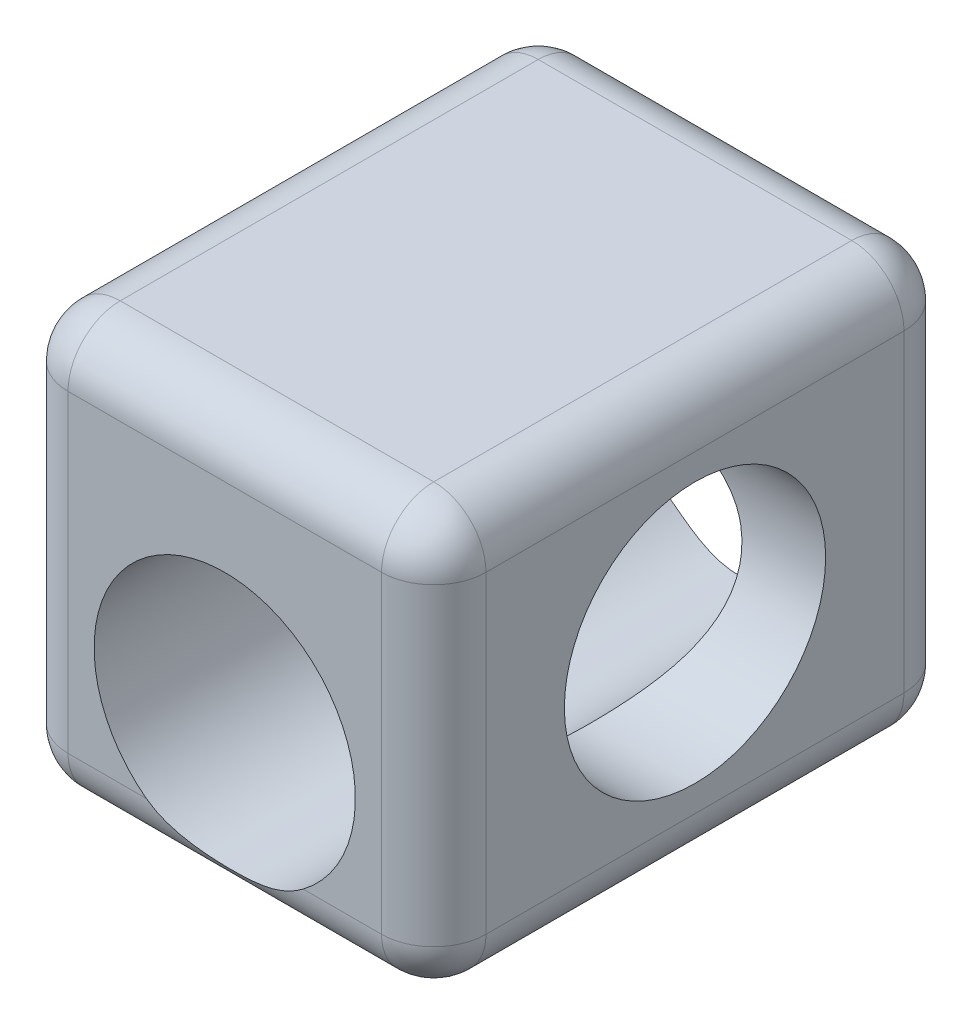
ISO-10303-21;
HEADER;
FILE_DESCRIPTION(('STEP AP214'),'2;1');
FILE_NAME('part.step','',(''),(''),'','','');
FILE_SCHEMA(('AUTOMOTIVE_DESIGN { 1 0 10303 214 1 1 1 1 }'));
ENDSEC;
DATA;
#1=APPLICATION_CONTEXT('core data for automotive mechanical design processes');
#2=APPLICATION_PROTOCOL_DEFINITION('international standard','automotive_design',2000,#1);
#3=PRODUCT_CONTEXT('',#1,'mechanical');
#4=PRODUCT('Part','Part','',(#3));
#5=PRODUCT_RELATED_PRODUCT_CATEGORY('part','',(#4));
#6=PRODUCT_DEFINITION_FORMATION('','',#4);
#7=PRODUCT_DEFINITION_CONTEXT('part definition',#1,'design');
#8=PRODUCT_DEFINITION('design','',#6,#7);
#9=PRODUCT_DEFINITION_SHAPE('','',#8);
#10=(LENGTH_UNIT() NAMED_UNIT(*) SI_UNIT(.MILLI.,.METRE.));
#11=(NAMED_UNIT(*) PLANE_ANGLE_UNIT() SI_UNIT($,.RADIAN.));
#12=(NAMED_UNIT(*) SI_UNIT($,.STERADIAN.) SOLID_ANGLE_UNIT());
#13=UNCERTAINTY_MEASURE_WITH_UNIT(LENGTH_MEASURE(1.E-05),#10,'distance_accuracy_value','');
#14=(GEOMETRIC_REPRESENTATION_CONTEXT(3) GLOBAL_UNCERTAINTY_ASSIGNED_CONTEXT((#13)) GLOBAL_UNIT_ASSIGNED_CONTEXT((#10,
#11,#12)) REPRESENTATION_CONTEXT('',''));
#15=CARTESIAN_POINT('',(0.,0.,0.));
#16=DIRECTION('',(0.,0.,1.));
#17=DIRECTION('',(1.,0.,0.));
#18=AXIS2_PLACEMENT_3D('',#15,#16,#17);
#19=CARTESIAN_POINT('',(0.,8.,10.));
#20=DIRECTION('',(1.,0.,0.));
#21=DIRECTION('',(0.,0.,-1.));
#22=AXIS2_PLACEMENT_3D('',#19,#20,#21);
#23=PLANE('',#22);
#24=DIRECTION('',(0.,0.,-1.));
#25=VECTOR('',#24,1.);
#26=CARTESIAN_POINT('',(0.,7.,10.));
#27=LINE('',#26,#25);
#28=CARTESIAN_POINT('',(0.,7.,9.));
#29=VERTEX_POINT('',#28);
#30=CARTESIAN_POINT('',(0.,7.,0.999999999999999));
#31=VERTEX_POINT('',#30);
#32=EDGE_CURVE('E178',#29,#31,#27,.T.);
#33=ORIENTED_EDGE('',*,*,#32,.T.);
#34=DIRECTION('',(0.,-1.,0.));
#35=VECTOR('',#34,1.);
#36=CARTESIAN_POINT('',(0.,8.,0.999999999999999));
#37=LINE('',#36,#35);
#38=CARTESIAN_POINT('',(0.,1.,0.999999999999999));
#39=VERTEX_POINT('',#38);
#40=EDGE_CURVE('E185',#31,#39,#37,.T.);
#41=ORIENTED_EDGE('',*,*,#40,.T.);
#42=DIRECTION('',(0.,0.,-1.));
#43=VECTOR('',#42,1.);
#44=CARTESIAN_POINT('',(0.,1.,10.));
#45=LINE('',#44,#43);
#46=CARTESIAN_POINT('',(0.,1.,9.));
#47=VERTEX_POINT('',#46);
#48=EDGE_CURVE('E146',#39,#47,#45,.F.);
#49=ORIENTED_EDGE('',*,*,#48,.T.);
#50=DIRECTION('',(0.,-1.,0.));
#51=VECTOR('',#50,1.);
#52=CARTESIAN_POINT('',(0.,8.,9.));
#53=LINE('',#52,#51);
#54=EDGE_CURVE('E176',#47,#29,#53,.F.);
#55=ORIENTED_EDGE('',*,*,#54,.T.);
#56=EDGE_LOOP('',(#33,#41,#49,#55));
#57=FACE_BOUND('',#56,.T.);
#58=CARTESIAN_POINT('',(0.,4.,5.));
#59=DIRECTION('',(1.,0.,0.));
#60=DIRECTION('',(0.,0.,-1.));
#61=AXIS2_PLACEMENT_3D('',#58,#59,#60);
#62=CIRCLE('',#61,2.5);
#63=CARTESIAN_POINT('',(0.,4.,2.5));
#64=VERTEX_POINT('',#63);
#65=EDGE_CURVE('E236',#64,#64,#62,.T.);
#66=ORIENTED_EDGE('',*,*,#65,.T.);
#67=EDGE_LOOP('',(#66));
#68=FACE_BOUND('',#67,.T.);
#69=ADVANCED_FACE('F39',(#57,#68),#23,.F.);
#70=CARTESIAN_POINT('',(0.,0.,10.));
#71=DIRECTION('',(0.,1.,0.));
#72=DIRECTION('',(0.,0.,1.));
#73=AXIS2_PLACEMENT_3D('',#70,#71,#72);
#74=PLANE('',#73);
#75=DIRECTION('',(1.,0.,0.));
#76=VECTOR('',#75,1.);
#77=CARTESIAN_POINT('',(0.,0.,9.));
#78=LINE('',#77,#76);
#79=CARTESIAN_POINT('',(7.,0.,9.));
#80=VERTEX_POINT('',#79);
#81=CARTESIAN_POINT('',(1.,0.,9.));
#82=VERTEX_POINT('',#81);
#83=EDGE_CURVE('E174',#80,#82,#78,.F.);
#84=ORIENTED_EDGE('',*,*,#83,.T.);
#85=DIRECTION('',(0.,0.,-1.));
#86=VECTOR('',#85,1.);
#87=CARTESIAN_POINT('',(1.,0.,10.));
#88=LINE('',#87,#86);
#89=CARTESIAN_POINT('',(1.,0.,0.999999999999999));
#90=VERTEX_POINT('',#89);
#91=EDGE_CURVE('E144',#82,#90,#88,.T.);
#92=ORIENTED_EDGE('',*,*,#91,.T.);
#93=DIRECTION('',(1.,0.,0.));
#94=VECTOR('',#93,1.);
#95=CARTESIAN_POINT('',(0.,0.,0.999999999999999));
#96=LINE('',#95,#94);
#97=CARTESIAN_POINT('',(7.,0.,0.999999999999999));
#98=VERTEX_POINT('',#97);
#99=EDGE_CURVE('E162',#90,#98,#96,.T.);
#100=ORIENTED_EDGE('',*,*,#99,.T.);
#101=DIRECTION('',(0.,0.,-1.));
#102=VECTOR('',#101,1.);
#103=CARTESIAN_POINT('',(7.,0.,10.));
#104=LINE('',#103,#102);
#105=EDGE_CURVE('E169',#98,#80,#104,.F.);
#106=ORIENTED_EDGE('',*,*,#105,.T.);
#107=EDGE_LOOP('',(#84,#92,#100,#106));
#108=FACE_BOUND('',#107,.T.);
#109=ADVANCED_FACE('F172',(#108),#74,.F.);
#110=CARTESIAN_POINT('',(8.,8.,10.));
#111=DIRECTION('',(-1.,0.,0.));
#112=DIRECTION('',(0.,0.,1.));
#113=AXIS2_PLACEMENT_3D('',#110,#111,#112);
#114=PLANE('',#113);
#115=DIRECTION('',(0.,0.,-1.));
#116=VECTOR('',#115,1.);
#117=CARTESIAN_POINT('',(8.,7.,10.));
#118=LINE('',#117,#116);
#119=CARTESIAN_POINT('',(8.,7.,0.999999999999999));
#120=VERTEX_POINT('',#119);
#121=CARTESIAN_POINT('',(8.,7.,9.));
#122=VERTEX_POINT('',#121);
#123=EDGE_CURVE('E338',#120,#122,#118,.F.);
#124=ORIENTED_EDGE('',*,*,#123,.T.);
#125=DIRECTION('',(0.,1.,0.));
#126=VECTOR('',#125,1.);
#127=CARTESIAN_POINT('',(8.,0.,9.));
#128=LINE('',#127,#126);
#129=CARTESIAN_POINT('',(8.,1.,9.));
#130=VERTEX_POINT('',#129);
#131=EDGE_CURVE('E345',#122,#130,#128,.F.);
#132=ORIENTED_EDGE('',*,*,#131,.T.);
#133=DIRECTION('',(0.,0.,-1.));
#134=VECTOR('',#133,1.);
#135=CARTESIAN_POINT('',(8.,1.,10.));
#136=LINE('',#135,#134);
#137=CARTESIAN_POINT('',(8.,1.,0.999999999999999));
#138=VERTEX_POINT('',#137);
#139=EDGE_CURVE('E248',#130,#138,#136,.T.);
#140=ORIENTED_EDGE('',*,*,#139,.T.);
#141=DIRECTION('',(0.,1.,0.));
#142=VECTOR('',#141,1.);
#143=CARTESIAN_POINT('',(8.,8.,0.999999999999999));
#144=LINE('',#143,#142);
#145=EDGE_CURVE('E337',#138,#120,#144,.T.);
#146=ORIENTED_EDGE('',*,*,#145,.T.);
#147=EDGE_LOOP('',(#124,#132,#140,#146));
#148=FACE_BOUND('',#147,.T.);
#149=CARTESIAN_POINT('',(8.,4.,5.));
#150=DIRECTION('',(1.,0.,0.));
#151=DIRECTION('',(0.,0.,-1.));
#152=AXIS2_PLACEMENT_3D('',#149,#150,#151);
#153=CIRCLE('',#152,2.5);
#154=CARTESIAN_POINT('',(8.,4.,2.5));
#155=VERTEX_POINT('',#154);
#156=EDGE_CURVE('E317',#155,#155,#153,.T.);
#157=ORIENTED_EDGE('',*,*,#156,.F.);
#158=EDGE_LOOP('',(#157));
#159=FACE_BOUND('',#158,.T.);
#160=ADVANCED_FACE('F393',(#148,#159),#114,.F.);
#161=CARTESIAN_POINT('',(0.,8.,10.));
#162=DIRECTION('',(0.,-1.,0.));
#163=DIRECTION('',(0.,0.,-1.));
#164=AXIS2_PLACEMENT_3D('',#161,#162,#163);
#165=PLANE('',#164);
#166=DIRECTION('',(-1.,0.,0.));
#167=VECTOR('',#166,1.);
#168=CARTESIAN_POINT('',(8.,8.,9.));
#169=LINE('',#168,#167);
#170=CARTESIAN_POINT('',(1.,8.,9.));
#171=VERTEX_POINT('',#170);
#172=CARTESIAN_POINT('',(7.,8.,9.));
#173=VERTEX_POINT('',#172);
#174=EDGE_CURVE('E48',#171,#173,#169,.F.);
#175=ORIENTED_EDGE('',*,*,#174,.T.);
#176=DIRECTION('',(0.,0.,-1.));
#177=VECTOR('',#176,1.);
#178=CARTESIAN_POINT('',(7.,8.,10.));
#179=LINE('',#178,#177);
#180=CARTESIAN_POINT('',(7.,8.,0.999999999999999));
#181=VERTEX_POINT('',#180);
#182=EDGE_CURVE('E11',#173,#181,#179,.T.);
#183=ORIENTED_EDGE('',*,*,#182,.T.);
#184=DIRECTION('',(-1.,0.,0.));
#185=VECTOR('',#184,1.);
#186=CARTESIAN_POINT('',(0.,8.,0.999999999999999));
#187=LINE('',#186,#185);
#188=CARTESIAN_POINT('',(1.,8.,0.999999999999999));
#189=VERTEX_POINT('',#188);
#190=EDGE_CURVE('E357',#181,#189,#187,.T.);
#191=ORIENTED_EDGE('',*,*,#190,.T.);
#192=DIRECTION('',(0.,0.,-1.));
#193=VECTOR('',#192,1.);
#194=CARTESIAN_POINT('',(1.,8.,10.));
#195=LINE('',#194,#193);
#196=EDGE_CURVE('E59',#189,#171,#195,.F.);
#197=ORIENTED_EDGE('',*,*,#196,.T.);
#198=EDGE_LOOP('',(#175,#183,#191,#197));
#199=FACE_BOUND('',#198,.T.);
#200=ADVANCED_FACE('F360',(#199),#165,.F.);
#201=CARTESIAN_POINT('',(0.,0.,10.));
#202=DIRECTION('',(0.,0.,1.));
#203=DIRECTION('',(1.,0.,0.));
#204=AXIS2_PLACEMENT_3D('',#201,#202,#203);
#205=PLANE('',#204);
#206=DIRECTION('',(0.,-1.,0.));
#207=VECTOR('',#206,1.);
#208=CARTESIAN_POINT('',(1.,0.,10.));
#209=LINE('',#208,#207);
#210=CARTESIAN_POINT('',(1.,7.,10.));
#211=VERTEX_POINT('',#210);
#212=CARTESIAN_POINT('',(1.,1.,10.));
#213=VERTEX_POINT('',#212);
#214=EDGE_CURVE('E193',#211,#213,#209,.T.);
#215=ORIENTED_EDGE('',*,*,#214,.T.);
#216=DIRECTION('',(1.,0.,0.));
#217=VECTOR('',#216,1.);
#218=CARTESIAN_POINT('',(8.,1.,10.));
#219=LINE('',#218,#217);
#220=CARTESIAN_POINT('',(2.5,1.,10.));
#221=VERTEX_POINT('',#220);
#222=EDGE_CURVE('E195',#213,#221,#219,.T.);
#223=ORIENTED_EDGE('',*,*,#222,.T.);
#224=CARTESIAN_POINT('',(4.,3.,10.));
#225=DIRECTION('',(0.,0.,1.));
#226=DIRECTION('',(1.,0.,0.));
#227=AXIS2_PLACEMENT_3D('',#224,#225,#226);
#228=CIRCLE('',#227,2.5);
#229=CARTESIAN_POINT('',(5.5,1.,10.));
#230=VERTEX_POINT('',#229);
#231=EDGE_CURVE('E235',#230,#221,#228,.T.);
#232=ORIENTED_EDGE('',*,*,#231,.F.);
#233=DIRECTION('',(1.,0.,0.));
#234=VECTOR('',#233,1.);
#235=CARTESIAN_POINT('',(8.,1.,10.));
#236=LINE('',#235,#234);
#237=CARTESIAN_POINT('',(7.,1.,10.));
#238=VERTEX_POINT('',#237);
#239=EDGE_CURVE('E191',#230,#238,#236,.T.);
#240=ORIENTED_EDGE('',*,*,#239,.T.);
#241=DIRECTION('',(0.,1.,0.));
#242=VECTOR('',#241,1.);
#243=CARTESIAN_POINT('',(7.,8.,10.));
#244=LINE('',#243,#242);
#245=CARTESIAN_POINT('',(7.,7.,10.));
#246=VERTEX_POINT('',#245);
#247=EDGE_CURVE('E187',#238,#246,#244,.T.);
#248=ORIENTED_EDGE('',*,*,#247,.T.);
#249=DIRECTION('',(-1.,0.,0.));
#250=VECTOR('',#249,1.);
#251=CARTESIAN_POINT('',(0.,7.,10.));
#252=LINE('',#251,#250);
#253=EDGE_CURVE('E189',#246,#211,#252,.T.);
#254=ORIENTED_EDGE('',*,*,#253,.T.);
#255=EDGE_LOOP('',(#215,#223,#232,#240,#248,#254));
#256=FACE_BOUND('',#255,.T.);
#257=ADVANCED_FACE('F224',(#256),#205,.T.);
#258=CARTESIAN_POINT('',(0.,0.,0.));
#259=DIRECTION('',(0.,0.,1.));
#260=DIRECTION('',(1.,0.,0.));
#261=AXIS2_PLACEMENT_3D('',#258,#259,#260);
#262=PLANE('',#261);
#263=CARTESIAN_POINT('',(4.,3.,0.));
#264=DIRECTION('',(0.,0.,1.));
#265=DIRECTION('',(1.,0.,0.));
#266=AXIS2_PLACEMENT_3D('',#263,#264,#265);
#267=CIRCLE('',#266,2.5);
#268=CARTESIAN_POINT('',(5.5,1.,0.));
#269=VERTEX_POINT('',#268);
#270=CARTESIAN_POINT('',(2.5,1.,0.));
#271=VERTEX_POINT('',#270);
#272=EDGE_CURVE('E170',#269,#271,#267,.T.);
#273=ORIENTED_EDGE('',*,*,#272,.T.);
#274=DIRECTION('',(1.,0.,0.));
#275=VECTOR('',#274,1.);
#276=CARTESIAN_POINT('',(0.,1.,0.));
#277=LINE('',#276,#275);
#278=CARTESIAN_POINT('',(1.,1.,0.));
#279=VERTEX_POINT('',#278);
#280=EDGE_CURVE('E355',#271,#279,#277,.F.);
#281=ORIENTED_EDGE('',*,*,#280,.T.);
#282=DIRECTION('',(0.,-1.,0.));
#283=VECTOR('',#282,1.);
#284=CARTESIAN_POINT('',(1.,0.,0.));
#285=LINE('',#284,#283);
#286=CARTESIAN_POINT('',(1.,7.,0.));
#287=VERTEX_POINT('',#286);
#288=EDGE_CURVE('E353',#279,#287,#285,.F.);
#289=ORIENTED_EDGE('',*,*,#288,.T.);
#290=DIRECTION('',(-1.,0.,0.));
#291=VECTOR('',#290,1.);
#292=CARTESIAN_POINT('',(0.,7.,0.));
#293=LINE('',#292,#291);
#294=CARTESIAN_POINT('',(7.,7.,0.));
#295=VERTEX_POINT('',#294);
#296=EDGE_CURVE('E349',#287,#295,#293,.F.);
#297=ORIENTED_EDGE('',*,*,#296,.T.);
#298=DIRECTION('',(0.,1.,0.));
#299=VECTOR('',#298,1.);
#300=CARTESIAN_POINT('',(7.,0.,0.));
#301=LINE('',#300,#299);
#302=CARTESIAN_POINT('',(7.,1.,0.));
#303=VERTEX_POINT('',#302);
#304=EDGE_CURVE('E347',#295,#303,#301,.F.);
#305=ORIENTED_EDGE('',*,*,#304,.T.);
#306=DIRECTION('',(1.,0.,0.));
#307=VECTOR('',#306,1.);
#308=CARTESIAN_POINT('',(0.,1.,0.));
#309=LINE('',#308,#307);
#310=EDGE_CURVE('E351',#303,#269,#309,.F.);
#311=ORIENTED_EDGE('',*,*,#310,.T.);
#312=EDGE_LOOP('',(#273,#281,#289,#297,#305,#311));
#313=FACE_BOUND('',#312,.T.);
#314=ADVANCED_FACE('F221',(#313),#262,.F.);
#315=CARTESIAN_POINT('',(4.,3.,0.));
#316=DIRECTION('',(0.,0.,1.));
#317=DIRECTION('',(1.,0.,0.));
#318=AXIS2_PLACEMENT_3D('',#315,#316,#317);
#319=CYLINDRICAL_SURFACE('',#318,2.5);
#320=CARTESIAN_POINT('',(6.5,3.,2.70871215252208));
#321=CARTESIAN_POINT('',(6.49999562364936,3.09636960452705,2.66665855443377));
#322=CARTESIAN_POINT('',(6.49438575877949,3.19556881166246,2.63065105152135));
#323=CARTESIAN_POINT('',(6.47044673908892,3.39640948639411,2.57169588159378));
#324=CARTESIAN_POINT('',(6.45209833179578,3.49805442559262,2.54876807833862));
#325=CARTESIAN_POINT('',(6.40222099724885,3.70010410872438,2.51594568100622));
#326=CARTESIAN_POINT('',(6.37070477042136,3.80050995195799,2.50603856647941));
#327=CARTESIAN_POINT('',(6.29506276880355,3.99688073206936,2.49806817258387));
#328=CARTESIAN_POINT('',(6.25093648607998,4.09284548987917,2.50000537036833));
#329=CARTESIAN_POINT('',(6.15125102895226,4.27796558041941,2.51376366906602));
#330=CARTESIAN_POINT('',(6.09567634099558,4.36711144581123,2.5255982490538));
#331=CARTESIAN_POINT('',(5.97457848702095,4.53685577901222,2.55679631081302));
#332=CARTESIAN_POINT('',(5.90905272574542,4.6174520077201,2.57616175871047));
#333=CARTESIAN_POINT('',(5.75750715261842,4.78205458744057,2.6236757924567));
#334=CARTESIAN_POINT('',(5.66989616694538,4.8643234565722,2.65275674118729));
#335=CARTESIAN_POINT('',(5.48438159720916,5.01517804145889,2.71394268962489));
#336=CARTESIAN_POINT('',(5.38646125390324,5.08374093514179,2.7460526042268));
#337=CARTESIAN_POINT('',(5.16237081239974,5.21788172724494,2.81517560470562));
#338=CARTESIAN_POINT('',(5.03434373578047,5.28049856749785,2.85198141884712));
#339=CARTESIAN_POINT('',(4.76762828224132,5.38350155801717,2.91681270659734));
#340=CARTESIAN_POINT('',(4.62896090007119,5.42393026505634,2.94485494390234));
#341=CARTESIAN_POINT('',(4.37504114183675,5.47432971303752,2.9808177778126));
#342=CARTESIAN_POINT('',(4.26115505431852,5.48897670538954,2.9917661810105));
#343=CARTESIAN_POINT('',(4.03197737881639,5.50242324075191,3.00179820440639));
#344=CARTESIAN_POINT('',(3.9166871570823,5.50123712348794,3.00089256058836));
#345=CARTESIAN_POINT('',(3.68828504171465,5.48313375120246,2.98743315875676));
#346=CARTESIAN_POINT('',(3.57516994961521,5.46624174109742,2.97489809340124));
#347=CARTESIAN_POINT('',(3.35359150571878,5.41765506817081,2.94060204106742));
#348=CARTESIAN_POINT('',(3.2451334733686,5.38594394509152,2.9188307975342));
#349=CARTESIAN_POINT('',(3.02703004262816,5.30603308912638,2.86770636110957));
#350=CARTESIAN_POINT('',(2.91786787234533,5.25680524400577,2.83791814661825));
#351=CARTESIAN_POINT('',(2.70809282856325,5.14364216954425,2.77598424656095));
#352=CARTESIAN_POINT('',(2.60748925990151,5.07969120628138,2.74383606422039));
#353=CARTESIAN_POINT('',(2.39699316019848,4.92373644152193,2.67505978513707));
#354=CARTESIAN_POINT('',(2.28920976350403,4.82868493024152,2.63880616047695));
#355=CARTESIAN_POINT('',(2.09034682965117,4.619849513422,2.57561674607517));
#356=CARTESIAN_POINT('',(1.9992411369208,4.50609548020693,2.5486663063537));
#357=CARTESIAN_POINT('',(1.85831446963736,4.29418734391639,2.51569157318341));
#358=CARTESIAN_POINT('',(1.80391459038605,4.19964093074983,2.50605248996927));
#359=CARTESIAN_POINT('',(1.70781127649285,4.00385523843533,2.49809028957286));
#360=CARTESIAN_POINT('',(1.66609556263093,3.9026225484383,2.49975619164543));
#361=CARTESIAN_POINT('',(1.59636017937647,3.69602519381801,2.5163781910643));
#362=CARTESIAN_POINT('',(1.56840366748648,3.59064382975396,2.53139470250632));
#363=CARTESIAN_POINT('',(1.52672781754488,3.38005945370369,2.57569734001322));
#364=CARTESIAN_POINT('',(1.51300860574556,3.27485644330733,2.60498359261467));
#365=CARTESIAN_POINT('',(1.49929042012606,3.07569696262362,2.67491247557134));
#366=CARTESIAN_POINT('',(1.49840194937765,2.98146764947102,2.71462149314084));
#367=CARTESIAN_POINT('',(1.50642283049841,2.79893151735397,2.80504680635885));
#368=CARTESIAN_POINT('',(1.51533480727163,2.7106262917908,2.85576604801128));
#369=CARTESIAN_POINT('',(1.5419627684122,2.53455934912744,2.97157648338016));
#370=CARTESIAN_POINT('',(1.56035323384247,2.44746180500528,3.0375153024269));
#371=CARTESIAN_POINT('',(1.60338606454822,2.2834509458013,3.17922306528643));
#372=CARTESIAN_POINT('',(1.6280315200912,2.20654269339105,3.25499685898467));
#373=CARTESIAN_POINT('',(1.68588939262996,2.04964493049329,3.43074530089175));
#374=CARTESIAN_POINT('',(1.71983521600732,1.97197920813149,3.53255777802295));
#375=CARTESIAN_POINT('',(1.78777191158143,1.83293393860121,3.74691902381809));
#376=CARTESIAN_POINT('',(1.8217627616599,1.7715824424272,3.85948583784667));
#377=CARTESIAN_POINT('',(1.88877535536037,1.65925579280959,4.10998718712405));
#378=CARTESIAN_POINT('',(1.92104971588306,1.61079179581959,4.24929627745561));
#379=CARTESIAN_POINT('',(1.95845430792976,1.55689255850258,4.46455292858872));
#380=CARTESIAN_POINT('',(1.96908383792828,1.54206337261575,4.53729238394436));
#381=CARTESIAN_POINT('',(1.98591336103457,1.51889726942397,4.68431810670796));
#382=CARTESIAN_POINT('',(1.99211480137615,1.51055823086204,4.75860386056219));
#383=CARTESIAN_POINT('',(1.99900367864985,1.5013202664089,4.89677046066263));
#384=CARTESIAN_POINT('',(2.00037347234405,1.49949999588053,4.96055736878207));
#385=CARTESIAN_POINT('',(1.99944922954483,1.50073641538939,5.08806425292482));
#386=CARTESIAN_POINT('',(1.99715401722693,1.50379467057787,5.15178420090222));
#387=CARTESIAN_POINT('',(1.98491596928052,1.5202460456157,5.34199807719833));
#388=CARTESIAN_POINT('',(1.96962386806199,1.54091143499317,5.46761245083302));
#389=CARTESIAN_POINT('',(1.93024455843012,1.59745544569817,5.70057214050699));
#390=CARTESIAN_POINT('',(1.90714469485372,1.63167973962442,5.80851258198411));
#391=CARTESIAN_POINT('',(1.85570579010303,1.71378376786906,6.0177650621544));
#392=CARTESIAN_POINT('',(1.82736359681227,1.7616717273482,6.11907306299736));
#393=CARTESIAN_POINT('',(1.76314742935553,1.88109344227483,6.33347764185705));
#394=CARTESIAN_POINT('',(1.72689794025508,1.95543743319845,6.44490117467264));
#395=CARTESIAN_POINT('',(1.65768562628312,2.12156200751489,6.65510957097795));
#396=CARTESIAN_POINT('',(1.62472212966815,2.2133390159476,6.75389701879049));
#397=CARTESIAN_POINT('',(1.5715298621127,2.39950481391521,6.92407962782446));
#398=CARTESIAN_POINT('',(1.550177508281,2.49183095038242,6.99737314261193));
#399=CARTESIAN_POINT('',(1.51767266181992,2.68725605937999,7.13087709283855));
#400=CARTESIAN_POINT('',(1.50651184873108,2.79034616734491,7.19109817004861));
#401=CARTESIAN_POINT('',(1.4998851604794,2.95137084879306,7.27024705746869));
#402=CARTESIAN_POINT('',(1.49938399313614,3.00638579127793,7.29485551032606));
#403=CARTESIAN_POINT('',(1.50216235907095,3.11795703216047,7.34000264982054));
#404=CARTESIAN_POINT('',(1.50543996176333,3.17451252907592,7.36054340837548));
#405=CARTESIAN_POINT('',(1.51605289151254,3.28859284944508,7.39739258565107));
#406=CARTESIAN_POINT('',(1.52338661208008,3.34611728039734,7.41370267623974));
#407=CARTESIAN_POINT('',(1.54227007431674,3.46150643259171,7.44204019056732));
#408=CARTESIAN_POINT('',(1.55381926875049,3.51937110870572,7.45406816979202));
#409=CARTESIAN_POINT('',(1.59123329284503,3.67700951954523,7.48111089699153));
#410=CARTESIAN_POINT('',(1.62139448178945,3.77654933546772,7.49189920472478));
#411=CARTESIAN_POINT('',(1.69412895734433,3.97150082445773,7.501748890102));
#412=CARTESIAN_POINT('',(1.73670449313262,4.06691174586951,7.50080814143524));
#413=CARTESIAN_POINT('',(1.83349050387682,4.25188715848501,7.48901829180106));
#414=CARTESIAN_POINT('',(1.88779077675297,4.34139914638454,7.47809048698529));
#415=CARTESIAN_POINT('',(2.00639190566996,4.51206614392245,7.44853076982768));
#416=CARTESIAN_POINT('',(2.07069511079133,4.59321918309227,7.42989704612502));
#417=CARTESIAN_POINT('',(2.21925378989226,4.75876607012343,7.38386491166031));
#418=CARTESIAN_POINT('',(2.30505207214521,4.84151151031655,7.35553058206475));
#419=CARTESIAN_POINT('',(2.48688181723827,4.99363019678246,7.29551822208842));
#420=CARTESIAN_POINT('',(2.58292937187074,5.0629819201343,7.26383493446152));
#421=CARTESIAN_POINT('',(2.80326623743487,5.19947525667264,7.19502820485869));
#422=CARTESIAN_POINT('',(2.92944395549193,5.26365842036529,7.15802299421092));
#423=CARTESIAN_POINT('',(3.19257449069017,5.37025844620234,7.09197486574972));
#424=CARTESIAN_POINT('',(3.32950891487487,5.41271156884843,7.06291872145779));
#425=CARTESIAN_POINT('',(3.58161933597555,5.46737653851487,7.02427463773899));
#426=CARTESIAN_POINT('',(3.69538994450608,5.4840443091868,7.01189297112861));
#427=CARTESIAN_POINT('',(3.92475464818978,5.50150580384605,6.99890376828337));
#428=CARTESIAN_POINT('',(4.04034666411498,5.50231647743822,6.99828366017442));
#429=CARTESIAN_POINT('',(4.26983564966892,5.48805293952072,7.0089211979309));
#430=CARTESIAN_POINT('',(4.38373410470858,5.47299359681313,7.02016772581983));
#431=CARTESIAN_POINT('',(4.60712922692672,5.42784203858947,7.05231954492697));
#432=CARTESIAN_POINT('',(4.71662071390214,5.39773265966891,7.07323586174309));
#433=CARTESIAN_POINT('',(4.93536030836218,5.32148354771546,7.12269886966573));
#434=CARTESIAN_POINT('',(5.04423532458913,5.27452447428068,7.1516139649913));
#435=CARTESIAN_POINT('',(5.25374261735999,5.16611707952636,7.21224542842442));
#436=CARTESIAN_POINT('',(5.35436641738349,5.10465410344438,7.24396460937825));
#437=CARTESIAN_POINT('',(5.56583081585669,4.95404331503916,7.31256915003031));
#438=CARTESIAN_POINT('',(5.67458070719677,4.86180671888253,7.34919156715775));
#439=CARTESIAN_POINT('',(5.87596275506494,4.65865366662464,7.41402166743761));
#440=CARTESIAN_POINT('',(5.96861673281396,4.5477629080783,7.44224078062672));
#441=CARTESIAN_POINT('',(6.11394000460549,4.33910477647271,7.47856705990134));
#442=CARTESIAN_POINT('',(6.17083459924625,4.2448481743515,7.48991831368601));
#443=CARTESIAN_POINT('',(6.27189001757165,4.0490999595036,7.50143366260894));
#444=CARTESIAN_POINT('',(6.31606325580254,3.94761552178736,7.50160870149716));
#445=CARTESIAN_POINT('',(6.39057369693342,3.73985857736837,7.48861451157638));
#446=CARTESIAN_POINT('',(6.42083936088447,3.63356433679003,7.47537738479211));
#447=CARTESIAN_POINT('',(6.46676616367562,3.42062362056066,7.4343516909419));
#448=CARTESIAN_POINT('',(6.48242852203144,3.31397717506867,7.40656433926162));
#449=CARTESIAN_POINT('',(6.49933834828347,3.11271293969574,7.33946234637597));
#450=CARTESIAN_POINT('',(6.5016312226401,3.01781224989861,7.30123762601708));
#451=CARTESIAN_POINT('',(6.49616238367775,2.83366477468027,7.21360999362048));
#452=CARTESIAN_POINT('',(6.48839802366393,2.74441948403646,7.16420414194369));
#453=CARTESIAN_POINT('',(6.46398398250955,2.56713801829029,7.0515203011866));
#454=CARTESIAN_POINT('',(6.4467267159019,2.47966630919601,6.98749264362777));
#455=CARTESIAN_POINT('',(6.40571856326536,2.31460783892092,6.84960544999337));
#456=CARTESIAN_POINT('',(6.38196488652063,2.23702534697841,6.77574169555829));
#457=CARTESIAN_POINT('',(6.32580184197004,2.07859145683545,6.60445579591041));
#458=CARTESIAN_POINT('',(6.29260608093013,1.9999633919507,6.50523172266139));
#459=CARTESIAN_POINT('',(6.22555639143772,1.85849326390498,6.29612846686979));
#460=CARTESIAN_POINT('',(6.19170139584072,1.79567957227878,6.18623061765695));
#461=CARTESIAN_POINT('',(6.1236733920156,1.67892313257905,5.94005896357947));
#462=CARTESIAN_POINT('',(6.09018565983407,1.62764303467006,5.80228295399186));
#463=CARTESIAN_POINT('',(6.05023845044756,1.56924100603216,5.58894097790305));
#464=CARTESIAN_POINT('',(6.03864164823321,1.55286539310633,5.51677081393821));
#465=CARTESIAN_POINT('',(6.01968885912047,1.52652619459114,5.37070474084965));
#466=CARTESIAN_POINT('',(6.01233153166182,1.5165605819857,5.29680938494615));
#467=CARTESIAN_POINT('',(6.0031289362302,1.50416449582902,5.15807526836817));
#468=CARTESIAN_POINT('',(6.00067732534347,1.50090348273627,5.09334928860552));
#469=CARTESIAN_POINT('',(5.99956746421701,1.49942292949019,4.96378227243062));
#470=CARTESIAN_POINT('',(6.00091042503667,1.50120499886594,4.89894120588775));
#471=CARTESIAN_POINT('',(6.00730639702355,1.50978213610896,4.76977246385658));
#472=CARTESIAN_POINT('',(6.01235975163225,1.51657766803265,4.70544483645046));
#473=CARTESIAN_POINT('',(6.02584992895436,1.53505624536543,4.57784526539264));
#474=CARTESIAN_POINT('',(6.03428827618602,1.54674149308591,4.51457381080744));
#475=CARTESIAN_POINT('',(6.06167440967827,1.58563345711703,4.34146897450385));
#476=CARTESIAN_POINT('',(6.08371520091582,1.61786732776688,4.23321783666451));
#477=CARTESIAN_POINT('',(6.13346363450916,1.69598251758634,4.0232235135613));
#478=CARTESIAN_POINT('',(6.16117421659597,1.74187092212798,3.92148374044669));
#479=CARTESIAN_POINT('',(6.22422101190976,1.85637198542594,3.70681238685204));
#480=CARTESIAN_POINT('',(6.26000598050268,1.92764524819732,3.59542492182071));
#481=CARTESIAN_POINT('',(6.32908588490527,2.08735201969103,3.3846821638003));
#482=CARTESIAN_POINT('',(6.36237950622002,2.17579450008258,3.2853332057348));
#483=CARTESIAN_POINT('',(6.41785080072037,2.3580818583909,3.11102940341114));
#484=CARTESIAN_POINT('',(6.44084946073102,2.45025517671251,3.03459260901016));
#485=CARTESIAN_POINT('',(6.47675801994192,2.64578843271328,2.89514475375822));
#486=CARTESIAN_POINT('',(6.48970473673738,2.74910595249959,2.83208531821703));
#487=CARTESIAN_POINT('',(6.49723614665716,2.88012399372608,2.7646963749135));
#488=CARTESIAN_POINT('',(6.49826393429908,2.90383166613537,2.75297653376411));
#489=CARTESIAN_POINT('',(6.4996465808781,2.95163292878745,2.73028040328201));
#490=CARTESIAN_POINT('',(6.50000110230237,2.97572670648761,2.71930448954224));
#491=CARTESIAN_POINT('',(6.5,3.,2.70871215252208));
#492=B_SPLINE_CURVE_WITH_KNOTS('',3,(#320,#321,#322,#323,#324,#325,#326,#327,#328,#329,#330,
#331,#332,#333,#334,#335,#336,#337,#338,#339,#340,#341,#342,#343,#344,#345,#346,#347,#348,#349,
#350,#351,#352,#353,#354,#355,#356,#357,#358,#359,#360,#361,#362,#363,#364,#365,#366,#367,#368,
#369,#370,#371,#372,#373,#374,#375,#376,#377,#378,#379,#380,#381,#382,#383,#384,#385,#386,#387,
#388,#389,#390,#391,#392,#393,#394,#395,#396,#397,#398,#399,#400,#401,#402,#403,#404,#405,#406,
#407,#408,#409,#410,#411,#412,#413,#414,#415,#416,#417,#418,#419,#420,#421,#422,#423,#424,#425,
#426,#427,#428,#429,#430,#431,#432,#433,#434,#435,#436,#437,#438,#439,#440,#441,#442,#443,#444,
#445,#446,#447,#448,#449,#450,#451,#452,#453,#454,#455,#456,#457,#458,#459,#460,#461,#462,#463,
#464,#465,#466,#467,#468,#469,#470,#471,#472,#473,#474,#475,#476,#477,#478,#479,#480,#481,#482,
#483,#484,#485,#486,#487,#488,#489,#490,#491),.UNSPECIFIED.,.T.,.F.,(4,2,2,2,2,2,2,2,2,2,2,2,2,
2,2,2,2,2,2,2,2,2,2,2,2,2,2,2,2,2,2,2,2,2,2,2,2,2,2,2,2,2,2,2,2,2,2,2,2,2,2,2,2,2,2,2,2,2,2,2,2,
2,2,2,2,2,2,2,2,2,2,2,2,2,2,2,2,2,2,2,2,2,2,2,2,4),(0.,0.315330361842648,0.631138340551926,
0.946642421522343,1.26215921279375,1.57810640202047,1.89413613279298,2.26373221318754,
2.6339386804481,3.07344211332314,3.5120996074394,3.85655953812612,4.20070751963537,
4.54430328831685,4.888281614771,5.25718013614607,5.62647472756634,6.0689414412761,
6.51070817755905,6.83788072981274,7.16473553872022,7.49307700014436,7.82142137318127,
8.12688443941804,8.43242933932315,8.76354919033731,9.09483295009816,9.49071946980508,
9.88728234632448,10.3372666054368,10.5618943144782,10.7864485747349,10.9776392215084,
11.1688912192893,11.5511985967463,11.896736613793,12.2424830759105,12.6571187292997,
13.0716694456578,13.429691961099,13.7874219219438,13.968000350072,14.1484865609731,
14.3289013386097,14.5092927038718,14.8213335096441,15.1334308847886,15.4480091787077,
15.7626614597767,16.1288791219563,16.4956804652957,16.9326213104414,17.368830644196,
17.7142241192891,18.0592483841048,18.4039496788412,18.7490449787669,19.113904883708,
19.4791350341092,19.9187223964578,20.3577090791416,20.6884040817633,21.0187752628576,
21.3508273183063,21.6828516417477,21.9885242203571,22.2942772571123,22.622363412519,
22.9505907285464,23.3417257336995,23.7335575270574,24.1830069437476,24.4073941515496,
24.6317103670956,24.8259786560351,25.0203089538198,25.2146572414738,25.4090931573132,
25.7529433078432,26.0969721951573,26.5063384213175,26.9159191378961,27.2803284288887,
27.6433966050634,27.7227813067316,27.802205793985),.UNSPECIFIED.);
#493=CARTESIAN_POINT('',(6.5,3.,2.70871215252208));
#494=VERTEX_POINT('',#493);
#495=EDGE_CURVE('E229',#494,#494,#492,.T.);
#496=ORIENTED_EDGE('',*,*,#495,.T.);
#497=EDGE_LOOP('',(#496));
#498=FACE_BOUND('',#497,.T.);
#499=ORIENTED_EDGE('',*,*,#272,.F.);
#500=CARTESIAN_POINT('',(5.5,1.,0.));
#501=CARTESIAN_POINT('',(5.45109915950773,0.963316891527017,1.84088989459279E-05));
#502=CARTESIAN_POINT('',(5.4008970600418,0.928475147104674,0.00201622305583611));
#503=CARTESIAN_POINT('',(5.29829084212196,0.862678847128886,0.00891783427041357));
#504=CARTESIAN_POINT('',(5.24589002510163,0.831718723638953,0.0138174097860303));
#505=CARTESIAN_POINT('',(5.13898937547003,0.77369935220559,0.0254926342662123));
#506=CARTESIAN_POINT('',(5.08448393403802,0.746651591696296,0.0322736439242431));
#507=CARTESIAN_POINT('',(4.9737525337365,0.696632195111498,0.0467716307381945));
#508=CARTESIAN_POINT('',(4.91752584973031,0.673662305485699,0.054489006545722));
#509=CARTESIAN_POINT('',(4.74081299659498,0.608887092078576,0.0784584509585415));
#510=CARTESIAN_POINT('',(4.61760894714477,0.574120759579751,0.0947701370836305));
#511=CARTESIAN_POINT('',(4.42969272212779,0.536375751776701,0.113861271737832));
#512=CARTESIAN_POINT('',(4.36660456524646,0.526198037321581,0.119325943898274));
#513=CARTESIAN_POINT('',(4.23965202759184,0.510692761361325,0.127841871233203));
#514=CARTESIAN_POINT('',(4.17578768386612,0.505364969282315,0.130893241139436));
#515=CARTESIAN_POINT('',(4.04470901284993,0.499498335495296,0.134257187942112));
#516=CARTESIAN_POINT('',(3.9774802491838,0.499200141543302,0.134432128723267));
#517=CARTESIAN_POINT('',(3.84327933962238,0.504013603754983,0.13166557808374));
#518=CARTESIAN_POINT('',(3.77630721786069,0.509125756736966,0.128723800462758));
#519=CARTESIAN_POINT('',(3.64296895368375,0.524712760790138,0.120124582435398));
#520=CARTESIAN_POINT('',(3.57660517550735,0.535203354159454,0.114459173210301));
#521=CARTESIAN_POINT('',(3.44511260720279,0.561434135043332,0.101182069472778));
#522=CARTESIAN_POINT('',(3.37998456052879,0.577177383096449,0.0935692408717693));
#523=CARTESIAN_POINT('',(3.1933482151657,0.630304757133145,0.070061883094627));
#524=CARTESIAN_POINT('',(3.07381657461927,0.67441747310202,0.0528771117635284));
#525=CARTESIAN_POINT('',(2.90059508168403,0.753817184903843,0.0303912394348215));
#526=CARTESIAN_POINT('',(2.84394921811884,0.782435065978588,0.0234526021982505));
#527=CARTESIAN_POINT('',(2.73283688308769,0.844004094330228,0.0117440244620623));
#528=CARTESIAN_POINT('',(2.67836882630515,0.876952011831438,0.00697247923302646));
#529=CARTESIAN_POINT('',(2.58259788657268,0.940004538787528,0.00140815511158994));
#530=CARTESIAN_POINT('',(2.54083656379934,0.969364848328836,1.14798448642324E-05));
#531=CARTESIAN_POINT('',(2.5,1.,0.));
#532=B_SPLINE_CURVE_WITH_KNOTS('',3,(#500,#501,#502,#503,#504,#505,#506,#507,#508,#509,#510,
#511,#512,#513,#514,#515,#516,#517,#518,#519,#520,#521,#522,#523,#524,#525,#526,#527,#528,#529,
#530,#531),.UNSPECIFIED.,.F.,.F.,(4,2,2,2,2,2,2,2,2,2,2,2,2,2,2,4),(0.,0.183227335552206,
0.366188760751281,0.54967694068865,0.733243515421488,1.11852700688221,1.31075910728316,
1.50298206815321,1.70437742265279,1.90579127237692,2.1077980400068,2.30992271608093,
2.69384382625026,2.88522019604401,3.0764546198453,3.22953398028936),.UNSPECIFIED.);
#533=EDGE_CURVE('E198',#269,#271,#532,.T.);
#534=ORIENTED_EDGE('',*,*,#533,.T.);
#535=EDGE_LOOP('',(#499,#534));
#536=FACE_BOUND('',#535,.T.);
#537=ORIENTED_EDGE('',*,*,#231,.T.);
#538=CARTESIAN_POINT('',(2.5,1.,10.));
#539=CARTESIAN_POINT('',(2.54890084049227,0.963316891527017,9.99998159110105));
#540=CARTESIAN_POINT('',(2.5991029399582,0.928475147104674,9.99798377694416));
#541=CARTESIAN_POINT('',(2.70170915787804,0.862678847128886,9.99108216572959));
#542=CARTESIAN_POINT('',(2.75410997489837,0.831718723638954,9.98618259021397));
#543=CARTESIAN_POINT('',(2.86101062452997,0.77369935220559,9.97450736573379));
#544=CARTESIAN_POINT('',(2.91551606596198,0.746651591696296,9.96772635607576));
#545=CARTESIAN_POINT('',(3.0262474662635,0.696632195111498,9.9532283692618));
#546=CARTESIAN_POINT('',(3.08247415026969,0.673662305485699,9.94551099345428));
#547=CARTESIAN_POINT('',(3.25918700340502,0.608887092078576,9.92154154904146));
#548=CARTESIAN_POINT('',(3.38239105285522,0.574120759579751,9.90522986291637));
#549=CARTESIAN_POINT('',(3.57030727787221,0.536375751776701,9.88613872826217));
#550=CARTESIAN_POINT('',(3.63339543475354,0.526198037321581,9.88067405610173));
#551=CARTESIAN_POINT('',(3.76034797240816,0.510692761361326,9.8721581287668));
#552=CARTESIAN_POINT('',(3.82421231613387,0.505364969282316,9.86910675886056));
#553=CARTESIAN_POINT('',(3.95529098715006,0.499498335495296,9.86574281205789));
#554=CARTESIAN_POINT('',(4.0225197508162,0.499200141543302,9.86556787127673));
#555=CARTESIAN_POINT('',(4.15672066037762,0.504013603754983,9.86833442191626));
#556=CARTESIAN_POINT('',(4.22369278213931,0.509125756736966,9.87127619953724));
#557=CARTESIAN_POINT('',(4.35703104631625,0.524712760790138,9.8798754175646));
#558=CARTESIAN_POINT('',(4.42339482449265,0.535203354159454,9.8855408267897));
#559=CARTESIAN_POINT('',(4.55488739279722,0.561434135043333,9.89881793052722));
#560=CARTESIAN_POINT('',(4.62001543947121,0.577177383096449,9.90643075912823));
#561=CARTESIAN_POINT('',(4.8066517848343,0.630304757133145,9.92993811690537));
#562=CARTESIAN_POINT('',(4.92618342538073,0.674417473102021,9.94712288823647));
#563=CARTESIAN_POINT('',(5.09940491831597,0.753817184903843,9.96960876056518));
#564=CARTESIAN_POINT('',(5.15605078188116,0.782435065978588,9.97654739780175));
#565=CARTESIAN_POINT('',(5.2671631169123,0.844004094330228,9.98825597553794));
#566=CARTESIAN_POINT('',(5.32163117369485,0.876952011831437,9.99302752076697));
#567=CARTESIAN_POINT('',(5.41740211342732,0.940004538787529,9.99859184488841));
#568=CARTESIAN_POINT('',(5.45916343620066,0.969364848328836,9.99998852015514));
#569=CARTESIAN_POINT('',(5.5,1.,10.));
#570=B_SPLINE_CURVE_WITH_KNOTS('',3,(#538,#539,#540,#541,#542,#543,#544,#545,#546,#547,#548,
#549,#550,#551,#552,#553,#554,#555,#556,#557,#558,#559,#560,#561,#562,#563,#564,#565,#566,#567,
#568,#569),.UNSPECIFIED.,.F.,.F.,(4,2,2,2,2,2,2,2,2,2,2,2,2,2,2,4),(0.,0.183227335552206,
0.366188760751281,0.54967694068865,0.733243515421487,1.11852700688221,1.31075910728316,
1.50298206815321,1.70437742265278,1.90579127237692,2.1077980400068,2.30992271608094,
2.69384382625026,2.88522019604401,3.0764546198453,3.22953398028936),.UNSPECIFIED.);
#571=EDGE_CURVE('E206',#221,#230,#570,.T.);
#572=ORIENTED_EDGE('',*,*,#571,.T.);
#573=EDGE_LOOP('',(#537,#572));
#574=FACE_BOUND('',#573,.T.);
#575=ADVANCED_FACE('F215',(#498,#536,#574),#319,.F.);
#576=CARTESIAN_POINT('',(0.,4.,5.));
#577=DIRECTION('',(1.,0.,0.));
#578=DIRECTION('',(0.,0.,-1.));
#579=AXIS2_PLACEMENT_3D('',#576,#577,#578);
#580=CYLINDRICAL_SURFACE('',#579,2.5);
#581=ORIENTED_EDGE('',*,*,#156,.T.);
#582=EDGE_LOOP('',(#581));
#583=FACE_BOUND('',#582,.T.);
#584=ORIENTED_EDGE('',*,*,#65,.F.);
#585=EDGE_LOOP('',(#584));
#586=FACE_BOUND('',#585,.T.);
#587=ORIENTED_EDGE('',*,*,#495,.F.);
#588=EDGE_LOOP('',(#587));
#589=FACE_BOUND('',#588,.T.);
#590=ADVANCED_FACE('F220',(#583,#586,#589),#580,.F.);
#591=CARTESIAN_POINT('',(7.,7.,10.));
#592=DIRECTION('',(0.,0.,-1.));
#593=DIRECTION('',(-1.,0.,0.));
#594=AXIS2_PLACEMENT_3D('',#591,#592,#593);
#595=CYLINDRICAL_SURFACE('',#594,1.);
#596=CARTESIAN_POINT('',(7.,7.,9.));
#597=DIRECTION('',(0.,0.,1.));
#598=DIRECTION('',(1.,0.,0.));
#599=AXIS2_PLACEMENT_3D('',#596,#597,#598);
#600=CIRCLE('',#599,1.);
#601=EDGE_CURVE('E43',#122,#173,#600,.T.);
#602=ORIENTED_EDGE('',*,*,#601,.F.);
#603=ORIENTED_EDGE('',*,*,#123,.F.);
#604=CARTESIAN_POINT('',(7.,7.,0.999999999999999));
#605=DIRECTION('',(0.,0.,-1.));
#606=DIRECTION('',(-1.,0.,0.));
#607=AXIS2_PLACEMENT_3D('',#604,#605,#606);
#608=CIRCLE('',#607,1.);
#609=EDGE_CURVE('E310',#181,#120,#608,.T.);
#610=ORIENTED_EDGE('',*,*,#609,.F.);
#611=ORIENTED_EDGE('',*,*,#182,.F.);
#612=EDGE_LOOP('',(#602,#603,#610,#611));
#613=FACE_BOUND('',#612,.T.);
#614=ADVANCED_FACE('F41',(#613),#595,.T.);
#615=CARTESIAN_POINT('',(7.,7.,9.));
#616=DIRECTION('',(0.,1.,0.));
#617=DIRECTION('',(0.,0.,1.));
#618=AXIS2_PLACEMENT_3D('',#615,#616,#617);
#619=SPHERICAL_SURFACE('',#618,1.);
#620=CARTESIAN_POINT('',(7.,7.,9.));
#621=DIRECTION('',(0.,1.,0.));
#622=DIRECTION('',(0.,0.,1.));
#623=AXIS2_PLACEMENT_3D('',#620,#621,#622);
#624=CIRCLE('',#623,1.);
#625=EDGE_CURVE('E305',#122,#246,#624,.F.);
#626=ORIENTED_EDGE('',*,*,#625,.F.);
#627=ORIENTED_EDGE('',*,*,#601,.T.);
#628=CARTESIAN_POINT('',(7.,7.,9.));
#629=DIRECTION('',(1.,0.,0.));
#630=DIRECTION('',(0.,0.,-1.));
#631=AXIS2_PLACEMENT_3D('',#628,#629,#630);
#632=CIRCLE('',#631,1.);
#633=EDGE_CURVE('E308',#246,#173,#632,.F.);
#634=ORIENTED_EDGE('',*,*,#633,.F.);
#635=EDGE_LOOP('',(#626,#627,#634));
#636=FACE_BOUND('',#635,.T.);
#637=ADVANCED_FACE('F389',(#636),#619,.T.);
#638=CARTESIAN_POINT('',(7.,7.,1.));
#639=DIRECTION('',(1.,0.,0.));
#640=DIRECTION('',(0.,0.,-1.));
#641=AXIS2_PLACEMENT_3D('',#638,#639,#640);
#642=SPHERICAL_SURFACE('',#641,1.);
#643=CARTESIAN_POINT('',(7.,7.,1.));
#644=DIRECTION('',(1.,0.,0.));
#645=DIRECTION('',(0.,0.,-1.));
#646=AXIS2_PLACEMENT_3D('',#643,#644,#645);
#647=CIRCLE('',#646,1.);
#648=EDGE_CURVE('E299',#181,#295,#647,.F.);
#649=ORIENTED_EDGE('',*,*,#648,.F.);
#650=ORIENTED_EDGE('',*,*,#609,.T.);
#651=CARTESIAN_POINT('',(7.,7.,0.999999999999999));
#652=DIRECTION('',(0.,1.,0.));
#653=DIRECTION('',(0.,0.,1.));
#654=AXIS2_PLACEMENT_3D('',#651,#652,#653);
#655=CIRCLE('',#654,1.);
#656=EDGE_CURVE('E302',#295,#120,#655,.F.);
#657=ORIENTED_EDGE('',*,*,#656,.F.);
#658=EDGE_LOOP('',(#649,#650,#657));
#659=FACE_BOUND('',#658,.T.);
#660=ADVANCED_FACE('F401',(#659),#642,.T.);
#661=CARTESIAN_POINT('',(0.,7.,9.));
#662=DIRECTION('',(1.,0.,0.));
#663=DIRECTION('',(0.,0.,-1.));
#664=AXIS2_PLACEMENT_3D('',#661,#662,#663);
#665=CYLINDRICAL_SURFACE('',#664,1.);
#666=ORIENTED_EDGE('',*,*,#633,.T.);
#667=ORIENTED_EDGE('',*,*,#174,.F.);
#668=CARTESIAN_POINT('',(1.,7.,9.));
#669=DIRECTION('',(-1.,0.,0.));
#670=DIRECTION('',(0.,0.,1.));
#671=AXIS2_PLACEMENT_3D('',#668,#669,#670);
#672=CIRCLE('',#671,1.);
#673=EDGE_CURVE('E293',#211,#171,#672,.T.);
#674=ORIENTED_EDGE('',*,*,#673,.F.);
#675=ORIENTED_EDGE('',*,*,#253,.F.);
#676=EDGE_LOOP('',(#666,#667,#674,#675));
#677=FACE_BOUND('',#676,.T.);
#678=ADVANCED_FACE('F388',(#677),#665,.T.);
#679=CARTESIAN_POINT('',(7.,0.,9.));
#680=DIRECTION('',(0.,-1.,0.));
#681=DIRECTION('',(0.,0.,-1.));
#682=AXIS2_PLACEMENT_3D('',#679,#680,#681);
#683=CYLINDRICAL_SURFACE('',#682,1.);
#684=ORIENTED_EDGE('',*,*,#625,.T.);
#685=ORIENTED_EDGE('',*,*,#247,.F.);
#686=CARTESIAN_POINT('',(7.,1.,9.));
#687=DIRECTION('',(0.,-1.,0.));
#688=DIRECTION('',(0.,0.,-1.));
#689=AXIS2_PLACEMENT_3D('',#686,#687,#688);
#690=CIRCLE('',#689,1.);
#691=EDGE_CURVE('E252',#130,#238,#690,.T.);
#692=ORIENTED_EDGE('',*,*,#691,.F.);
#693=ORIENTED_EDGE('',*,*,#131,.F.);
#694=EDGE_LOOP('',(#684,#685,#692,#693));
#695=FACE_BOUND('',#694,.T.);
#696=ADVANCED_FACE('F392',(#695),#683,.T.);
#697=CARTESIAN_POINT('',(7.,1.,10.));
#698=DIRECTION('',(0.,0.,-1.));
#699=DIRECTION('',(-1.,0.,0.));
#700=AXIS2_PLACEMENT_3D('',#697,#698,#699);
#701=CYLINDRICAL_SURFACE('',#700,1.);
#702=CARTESIAN_POINT('',(7.,1.,0.999999999999999));
#703=DIRECTION('',(0.,0.,-1.));
#704=DIRECTION('',(-1.,0.,0.));
#705=AXIS2_PLACEMENT_3D('',#702,#703,#704);
#706=CIRCLE('',#705,1.);
#707=EDGE_CURVE('E253',#138,#98,#706,.T.);
#708=ORIENTED_EDGE('',*,*,#707,.F.);
#709=ORIENTED_EDGE('',*,*,#139,.F.);
#710=CARTESIAN_POINT('',(7.,1.,9.));
#711=DIRECTION('',(0.,0.,1.));
#712=DIRECTION('',(1.,0.,0.));
#713=AXIS2_PLACEMENT_3D('',#710,#711,#712);
#714=CIRCLE('',#713,1.);
#715=EDGE_CURVE('E244',#80,#130,#714,.T.);
#716=ORIENTED_EDGE('',*,*,#715,.F.);
#717=ORIENTED_EDGE('',*,*,#105,.F.);
#718=EDGE_LOOP('',(#708,#709,#716,#717));
#719=FACE_BOUND('',#718,.T.);
#720=ADVANCED_FACE('F246',(#719),#701,.T.);
#721=CARTESIAN_POINT('',(7.,8.,0.999999999999999));
#722=DIRECTION('',(0.,1.,0.));
#723=DIRECTION('',(0.,0.,1.));
#724=AXIS2_PLACEMENT_3D('',#721,#722,#723);
#725=CYLINDRICAL_SURFACE('',#724,1.);
#726=ORIENTED_EDGE('',*,*,#656,.T.);
#727=ORIENTED_EDGE('',*,*,#145,.F.);
#728=CARTESIAN_POINT('',(7.,1.,1.));
#729=DIRECTION('',(0.,-1.,0.));
#730=DIRECTION('',(0.,0.,-1.));
#731=AXIS2_PLACEMENT_3D('',#728,#729,#730);
#732=CIRCLE('',#731,1.);
#733=EDGE_CURVE('E289',#303,#138,#732,.T.);
#734=ORIENTED_EDGE('',*,*,#733,.F.);
#735=ORIENTED_EDGE('',*,*,#304,.F.);
#736=EDGE_LOOP('',(#726,#727,#734,#735));
#737=FACE_BOUND('',#736,.T.);
#738=ADVANCED_FACE('F442',(#737),#725,.T.);
#739=CARTESIAN_POINT('',(0.,7.,0.999999999999999));
#740=DIRECTION('',(-1.,0.,0.));
#741=DIRECTION('',(0.,0.,1.));
#742=AXIS2_PLACEMENT_3D('',#739,#740,#741);
#743=CYLINDRICAL_SURFACE('',#742,1.);
#744=ORIENTED_EDGE('',*,*,#648,.T.);
#745=ORIENTED_EDGE('',*,*,#296,.F.);
#746=CARTESIAN_POINT('',(1.,7.,0.999999999999999));
#747=DIRECTION('',(-1.,0.,0.));
#748=DIRECTION('',(0.,0.,1.));
#749=AXIS2_PLACEMENT_3D('',#746,#747,#748);
#750=CIRCLE('',#749,1.);
#751=EDGE_CURVE('E286',#189,#287,#750,.T.);
#752=ORIENTED_EDGE('',*,*,#751,.F.);
#753=ORIENTED_EDGE('',*,*,#190,.F.);
#754=EDGE_LOOP('',(#744,#745,#752,#753));
#755=FACE_BOUND('',#754,.T.);
#756=ADVANCED_FACE('F370',(#755),#743,.T.);
#757=CARTESIAN_POINT('',(1.,7.,10.));
#758=DIRECTION('',(0.,0.,-1.));
#759=DIRECTION('',(-1.,0.,0.));
#760=AXIS2_PLACEMENT_3D('',#757,#758,#759);
#761=CYLINDRICAL_SURFACE('',#760,1.);
#762=CARTESIAN_POINT('',(1.,7.,9.));
#763=DIRECTION('',(0.,0.,1.));
#764=DIRECTION('',(1.,0.,0.));
#765=AXIS2_PLACEMENT_3D('',#762,#763,#764);
#766=CIRCLE('',#765,1.);
#767=EDGE_CURVE('E296',#171,#29,#766,.T.);
#768=ORIENTED_EDGE('',*,*,#767,.F.);
#769=ORIENTED_EDGE('',*,*,#196,.F.);
#770=CARTESIAN_POINT('',(1.,7.,0.999999999999999));
#771=DIRECTION('',(0.,0.,-1.));
#772=DIRECTION('',(-1.,0.,0.));
#773=AXIS2_PLACEMENT_3D('',#770,#771,#772);
#774=CIRCLE('',#773,1.);
#775=EDGE_CURVE('E283',#31,#189,#774,.T.);
#776=ORIENTED_EDGE('',*,*,#775,.F.);
#777=ORIENTED_EDGE('',*,*,#32,.F.);
#778=EDGE_LOOP('',(#768,#769,#776,#777));
#779=FACE_BOUND('',#778,.T.);
#780=ADVANCED_FACE('F366',(#779),#761,.T.);
#781=CARTESIAN_POINT('',(1.,7.,9.));
#782=DIRECTION('',(0.,1.,0.));
#783=DIRECTION('',(0.,0.,1.));
#784=AXIS2_PLACEMENT_3D('',#781,#782,#783);
#785=SPHERICAL_SURFACE('',#784,1.);
#786=ORIENTED_EDGE('',*,*,#673,.T.);
#787=ORIENTED_EDGE('',*,*,#767,.T.);
#788=CARTESIAN_POINT('',(1.,7.,9.));
#789=DIRECTION('',(0.,1.,0.));
#790=DIRECTION('',(0.,0.,1.));
#791=AXIS2_PLACEMENT_3D('',#788,#789,#790);
#792=CIRCLE('',#791,1.);
#793=EDGE_CURVE('E260',#211,#29,#792,.F.);
#794=ORIENTED_EDGE('',*,*,#793,.F.);
#795=EDGE_LOOP('',(#786,#787,#794));
#796=FACE_BOUND('',#795,.T.);
#797=ADVANCED_FACE('F381',(#796),#785,.T.);
#798=CARTESIAN_POINT('',(7.,1.,9.));
#799=DIRECTION('',(1.,0.,0.));
#800=DIRECTION('',(0.,0.,-1.));
#801=AXIS2_PLACEMENT_3D('',#798,#799,#800);
#802=SPHERICAL_SURFACE('',#801,1.);
#803=ORIENTED_EDGE('',*,*,#715,.T.);
#804=ORIENTED_EDGE('',*,*,#691,.T.);
#805=CARTESIAN_POINT('',(7.,1.,9.));
#806=DIRECTION('',(1.,0.,0.));
#807=DIRECTION('',(0.,0.,-1.));
#808=AXIS2_PLACEMENT_3D('',#805,#806,#807);
#809=CIRCLE('',#808,1.);
#810=EDGE_CURVE('E256',#80,#238,#809,.F.);
#811=ORIENTED_EDGE('',*,*,#810,.F.);
#812=EDGE_LOOP('',(#803,#804,#811));
#813=FACE_BOUND('',#812,.T.);
#814=ADVANCED_FACE('F257',(#813),#802,.T.);
#815=CARTESIAN_POINT('',(7.,1.,1.));
#816=DIRECTION('',(1.,0.,0.));
#817=DIRECTION('',(0.,0.,-1.));
#818=AXIS2_PLACEMENT_3D('',#815,#816,#817);
#819=SPHERICAL_SURFACE('',#818,1.);
#820=ORIENTED_EDGE('',*,*,#733,.T.);
#821=ORIENTED_EDGE('',*,*,#707,.T.);
#822=CARTESIAN_POINT('',(7.,1.,0.999999999999999));
#823=DIRECTION('',(1.,0.,0.));
#824=DIRECTION('',(0.,0.,-1.));
#825=AXIS2_PLACEMENT_3D('',#822,#823,#824);
#826=CIRCLE('',#825,1.);
#827=EDGE_CURVE('E166',#303,#98,#826,.F.);
#828=ORIENTED_EDGE('',*,*,#827,.F.);
#829=EDGE_LOOP('',(#820,#821,#828));
#830=FACE_BOUND('',#829,.T.);
#831=ADVANCED_FACE('F430',(#830),#819,.T.);
#832=CARTESIAN_POINT('',(1.,7.,1.));
#833=DIRECTION('',(0.,1.,0.));
#834=DIRECTION('',(0.,0.,1.));
#835=AXIS2_PLACEMENT_3D('',#832,#833,#834);
#836=SPHERICAL_SURFACE('',#835,1.);
#837=ORIENTED_EDGE('',*,*,#775,.T.);
#838=ORIENTED_EDGE('',*,*,#751,.T.);
#839=CARTESIAN_POINT('',(1.,7.,1.));
#840=DIRECTION('',(0.,1.,0.));
#841=DIRECTION('',(0.,0.,1.));
#842=AXIS2_PLACEMENT_3D('',#839,#840,#841);
#843=CIRCLE('',#842,1.);
#844=EDGE_CURVE('E277',#31,#287,#843,.F.);
#845=ORIENTED_EDGE('',*,*,#844,.F.);
#846=EDGE_LOOP('',(#837,#838,#845));
#847=FACE_BOUND('',#846,.T.);
#848=ADVANCED_FACE('F372',(#847),#836,.T.);
#849=CARTESIAN_POINT('',(1.,0.,9.));
#850=DIRECTION('',(0.,1.,0.));
#851=DIRECTION('',(0.,0.,1.));
#852=AXIS2_PLACEMENT_3D('',#849,#850,#851);
#853=CYLINDRICAL_SURFACE('',#852,1.);
#854=ORIENTED_EDGE('',*,*,#793,.T.);
#855=ORIENTED_EDGE('',*,*,#54,.F.);
#856=CARTESIAN_POINT('',(1.,1.,9.));
#857=DIRECTION('',(0.,-1.,0.));
#858=DIRECTION('',(0.,0.,-1.));
#859=AXIS2_PLACEMENT_3D('',#856,#857,#858);
#860=CIRCLE('',#859,1.);
#861=EDGE_CURVE('E269',#213,#47,#860,.T.);
#862=ORIENTED_EDGE('',*,*,#861,.F.);
#863=ORIENTED_EDGE('',*,*,#214,.F.);
#864=EDGE_LOOP('',(#854,#855,#862,#863));
#865=FACE_BOUND('',#864,.T.);
#866=ADVANCED_FACE('F385',(#865),#853,.T.);
#867=CARTESIAN_POINT('',(0.,1.,9.));
#868=DIRECTION('',(-1.,0.,0.));
#869=DIRECTION('',(0.,0.,1.));
#870=AXIS2_PLACEMENT_3D('',#867,#868,#869);
#871=CYLINDRICAL_SURFACE('',#870,1.);
#872=ORIENTED_EDGE('',*,*,#571,.F.);
#873=ORIENTED_EDGE('',*,*,#222,.F.);
#874=CARTESIAN_POINT('',(1.,1.,9.));
#875=DIRECTION('',(-1.,0.,0.));
#876=DIRECTION('',(0.,0.,1.));
#877=AXIS2_PLACEMENT_3D('',#874,#875,#876);
#878=CIRCLE('',#877,1.);
#879=EDGE_CURVE('E159',#82,#213,#878,.T.);
#880=ORIENTED_EDGE('',*,*,#879,.F.);
#881=ORIENTED_EDGE('',*,*,#83,.F.);
#882=ORIENTED_EDGE('',*,*,#810,.T.);
#883=ORIENTED_EDGE('',*,*,#239,.F.);
#884=EDGE_LOOP('',(#872,#873,#880,#881,#882,#883));
#885=FACE_BOUND('',#884,.T.);
#886=ADVANCED_FACE('F262',(#885),#871,.T.);
#887=CARTESIAN_POINT('',(0.,1.,0.999999999999999));
#888=DIRECTION('',(1.,0.,0.));
#889=DIRECTION('',(0.,0.,-1.));
#890=AXIS2_PLACEMENT_3D('',#887,#888,#889);
#891=CYLINDRICAL_SURFACE('',#890,1.);
#892=ORIENTED_EDGE('',*,*,#827,.T.);
#893=ORIENTED_EDGE('',*,*,#99,.F.);
#894=CARTESIAN_POINT('',(1.,1.,1.));
#895=DIRECTION('',(-1.,0.,0.));
#896=DIRECTION('',(0.,0.,1.));
#897=AXIS2_PLACEMENT_3D('',#894,#895,#896);
#898=CIRCLE('',#897,1.);
#899=EDGE_CURVE('E152',#279,#90,#898,.T.);
#900=ORIENTED_EDGE('',*,*,#899,.F.);
#901=ORIENTED_EDGE('',*,*,#280,.F.);
#902=ORIENTED_EDGE('',*,*,#533,.F.);
#903=ORIENTED_EDGE('',*,*,#310,.F.);
#904=EDGE_LOOP('',(#892,#893,#900,#901,#902,#903));
#905=FACE_BOUND('',#904,.T.);
#906=ADVANCED_FACE('F163',(#905),#891,.T.);
#907=CARTESIAN_POINT('',(1.,8.,0.999999999999999));
#908=DIRECTION('',(0.,-1.,0.));
#909=DIRECTION('',(0.,0.,-1.));
#910=AXIS2_PLACEMENT_3D('',#907,#908,#909);
#911=CYLINDRICAL_SURFACE('',#910,1.);
#912=ORIENTED_EDGE('',*,*,#844,.T.);
#913=ORIENTED_EDGE('',*,*,#288,.F.);
#914=CARTESIAN_POINT('',(1.,1.,0.999999999999999));
#915=DIRECTION('',(0.,-1.,0.));
#916=DIRECTION('',(0.,0.,-1.));
#917=AXIS2_PLACEMENT_3D('',#914,#915,#916);
#918=CIRCLE('',#917,1.);
#919=EDGE_CURVE('E156',#39,#279,#918,.T.);
#920=ORIENTED_EDGE('',*,*,#919,.F.);
#921=ORIENTED_EDGE('',*,*,#40,.F.);
#922=EDGE_LOOP('',(#912,#913,#920,#921));
#923=FACE_BOUND('',#922,.T.);
#924=ADVANCED_FACE('F376',(#923),#911,.T.);
#925=CARTESIAN_POINT('',(1.,1.,9.));
#926=DIRECTION('',(0.,0.,1.));
#927=DIRECTION('',(1.,0.,0.));
#928=AXIS2_PLACEMENT_3D('',#925,#926,#927);
#929=SPHERICAL_SURFACE('',#928,1.);
#930=ORIENTED_EDGE('',*,*,#879,.T.);
#931=ORIENTED_EDGE('',*,*,#861,.T.);
#932=CARTESIAN_POINT('',(1.,1.,9.));
#933=DIRECTION('',(0.,0.,1.));
#934=DIRECTION('',(1.,0.,0.));
#935=AXIS2_PLACEMENT_3D('',#932,#933,#934);
#936=CIRCLE('',#935,1.);
#937=EDGE_CURVE('E149',#82,#47,#936,.F.);
#938=ORIENTED_EDGE('',*,*,#937,.F.);
#939=EDGE_LOOP('',(#930,#931,#938));
#940=FACE_BOUND('',#939,.T.);
#941=ADVANCED_FACE('F271',(#940),#929,.T.);
#942=CARTESIAN_POINT('',(1.,1.,1.));
#943=DIRECTION('',(0.,0.,-1.));
#944=DIRECTION('',(-1.,0.,0.));
#945=AXIS2_PLACEMENT_3D('',#942,#943,#944);
#946=SPHERICAL_SURFACE('',#945,1.);
#947=ORIENTED_EDGE('',*,*,#919,.T.);
#948=ORIENTED_EDGE('',*,*,#899,.T.);
#949=CARTESIAN_POINT('',(1.,1.,0.999999999999999));
#950=DIRECTION('',(0.,0.,-1.));
#951=DIRECTION('',(-1.,0.,0.));
#952=AXIS2_PLACEMENT_3D('',#949,#950,#951);
#953=CIRCLE('',#952,1.);
#954=EDGE_CURVE('E140',#39,#90,#953,.F.);
#955=ORIENTED_EDGE('',*,*,#954,.F.);
#956=EDGE_LOOP('',(#947,#948,#955));
#957=FACE_BOUND('',#956,.T.);
#958=ADVANCED_FACE('F154',(#957),#946,.T.);
#959=CARTESIAN_POINT('',(1.,1.,10.));
#960=DIRECTION('',(0.,0.,-1.));
#961=DIRECTION('',(-1.,0.,0.));
#962=AXIS2_PLACEMENT_3D('',#959,#960,#961);
#963=CYLINDRICAL_SURFACE('',#962,1.);
#964=ORIENTED_EDGE('',*,*,#937,.T.);
#965=ORIENTED_EDGE('',*,*,#48,.F.);
#966=ORIENTED_EDGE('',*,*,#954,.T.);
#967=ORIENTED_EDGE('',*,*,#91,.F.);
#968=EDGE_LOOP('',(#964,#965,#966,#967));
#969=FACE_BOUND('',#968,.T.);
#970=ADVANCED_FACE('F142',(#969),#963,.T.);
#971=CLOSED_SHELL('',(#69,#109,#160,#200,#257,#314,#575,#590,#614,#637,#660,#678,#696,#720,#738,
#756,#780,#797,#814,#831,#848,#866,#886,#906,#924,#941,#958,#970));
#972=MANIFOLD_SOLID_BREP('B2',#971);
#973=ADVANCED_BREP_SHAPE_REPRESENTATION('',(#18,#972),#14);
#974=SHAPE_DEFINITION_REPRESENTATION(#9,#973);
ENDSEC;
END-ISO-10303-21;
